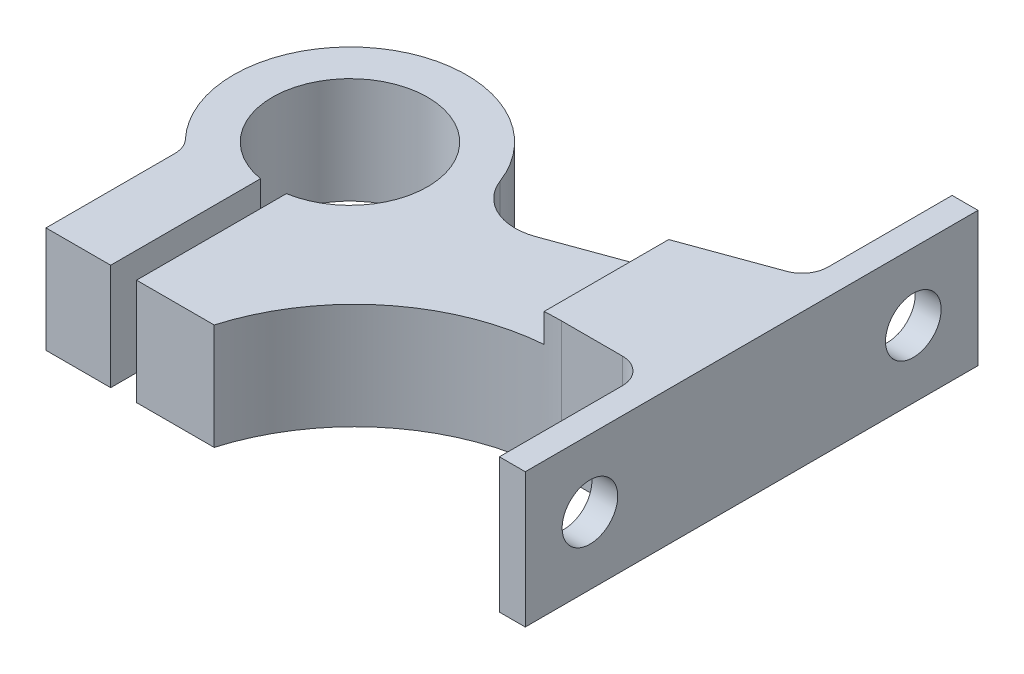
ISO-10303-21;
HEADER;
FILE_DESCRIPTION(('STEP AP214'),'2;1');
FILE_NAME('part.step','',(''),(''),'','','');
FILE_SCHEMA(('AUTOMOTIVE_DESIGN { 1 0 10303 214 1 1 1 1 }'));
ENDSEC;
DATA;
#1=APPLICATION_CONTEXT('core data for automotive mechanical design processes');
#2=APPLICATION_PROTOCOL_DEFINITION('international standard','automotive_design',2000,#1);
#3=PRODUCT_CONTEXT('',#1,'mechanical');
#4=PRODUCT('Part','Part','',(#3));
#5=PRODUCT_RELATED_PRODUCT_CATEGORY('part','',(#4));
#6=PRODUCT_DEFINITION_FORMATION('','',#4);
#7=PRODUCT_DEFINITION_CONTEXT('part definition',#1,'design');
#8=PRODUCT_DEFINITION('design','',#6,#7);
#9=PRODUCT_DEFINITION_SHAPE('','',#8);
#10=(LENGTH_UNIT() NAMED_UNIT(*) SI_UNIT(.MILLI.,.METRE.));
#11=(NAMED_UNIT(*) PLANE_ANGLE_UNIT() SI_UNIT($,.RADIAN.));
#12=(NAMED_UNIT(*) SI_UNIT($,.STERADIAN.) SOLID_ANGLE_UNIT());
#13=UNCERTAINTY_MEASURE_WITH_UNIT(LENGTH_MEASURE(1.E-05),#10,'distance_accuracy_value','');
#14=(GEOMETRIC_REPRESENTATION_CONTEXT(3) GLOBAL_UNCERTAINTY_ASSIGNED_CONTEXT((#13)) GLOBAL_UNIT_ASSIGNED_CONTEXT((#10,
#11,#12)) REPRESENTATION_CONTEXT('',''));
#15=CARTESIAN_POINT('',(0.,0.,0.));
#16=DIRECTION('',(0.,0.,1.));
#17=DIRECTION('',(1.,0.,0.));
#18=AXIS2_PLACEMENT_3D('',#15,#16,#17);
#19=CARTESIAN_POINT('',(-48.,10.4,17.5));
#20=DIRECTION('',(0.,0.,-1.));
#21=DIRECTION('',(-1.,0.,0.));
#22=AXIS2_PLACEMENT_3D('',#19,#20,#21);
#23=PLANE('',#22);
#24=DIRECTION('',(1.,0.,0.));
#25=VECTOR('',#24,1.);
#26=CARTESIAN_POINT('',(-48.,0.,17.5));
#27=LINE('',#26,#25);
#28=CARTESIAN_POINT('',(-37.05,0.,17.5));
#29=VERTEX_POINT('',#28);
#30=CARTESIAN_POINT('',(-32.05,0.,17.5));
#31=VERTEX_POINT('',#30);
#32=EDGE_CURVE('E281',#29,#31,#27,.T.);
#33=ORIENTED_EDGE('',*,*,#32,.T.);
#34=DIRECTION('',(0.,1.,0.));
#35=VECTOR('',#34,1.);
#36=CARTESIAN_POINT('',(-32.05,0.,17.5));
#37=LINE('',#36,#35);
#38=CARTESIAN_POINT('',(-32.05,8.2,17.5));
#39=VERTEX_POINT('',#38);
#40=EDGE_CURVE('E210',#31,#39,#37,.T.);
#41=ORIENTED_EDGE('',*,*,#40,.T.);
#42=DIRECTION('',(1.,0.,0.));
#43=VECTOR('',#42,1.);
#44=CARTESIAN_POINT('',(-48.,8.2,17.5));
#45=LINE('',#44,#43);
#46=CARTESIAN_POINT('',(-37.05,8.2,17.5));
#47=VERTEX_POINT('',#46);
#48=EDGE_CURVE('E262',#47,#39,#45,.T.);
#49=ORIENTED_EDGE('',*,*,#48,.F.);
#50=DIRECTION('',(0.,1.,0.));
#51=VECTOR('',#50,1.);
#52=CARTESIAN_POINT('',(-37.05,0.,17.5));
#53=LINE('',#52,#51);
#54=EDGE_CURVE('E233',#29,#47,#53,.T.);
#55=ORIENTED_EDGE('',*,*,#54,.F.);
#56=EDGE_LOOP('',(#33,#41,#49,#55));
#57=FACE_BOUND('',#56,.T.);
#58=ADVANCED_FACE('F32',(#57),#23,.F.);
#59=DIRECTION('',(1.,0.,0.));
#60=VECTOR('',#59,1.);
#61=CARTESIAN_POINT('',(-48.,10.4,17.5));
#62=LINE('',#61,#60);
#63=CARTESIAN_POINT('',(-1.99999999999999,10.4,17.5));
#64=VERTEX_POINT('',#63);
#65=CARTESIAN_POINT('',(0.,10.4,17.5));
#66=VERTEX_POINT('',#65);
#67=EDGE_CURVE('E272',#64,#66,#62,.T.);
#68=ORIENTED_EDGE('',*,*,#67,.F.);
#69=DIRECTION('',(0.,1.,0.));
#70=VECTOR('',#69,1.);
#71=CARTESIAN_POINT('',(-1.99999999999999,0.,17.5));
#72=LINE('',#71,#70);
#73=CARTESIAN_POINT('',(-1.99999999999999,0.,17.5));
#74=VERTEX_POINT('',#73);
#75=EDGE_CURVE('E251',#74,#64,#72,.T.);
#76=ORIENTED_EDGE('',*,*,#75,.F.);
#77=CARTESIAN_POINT('',(0.,0.,17.5));
#78=VERTEX_POINT('',#77);
#79=EDGE_CURVE('E269',#74,#78,#27,.T.);
#80=ORIENTED_EDGE('',*,*,#79,.T.);
#81=DIRECTION('',(0.,-1.,0.));
#82=VECTOR('',#81,1.);
#83=CARTESIAN_POINT('',(0.,10.4,17.5));
#84=LINE('',#83,#82);
#85=EDGE_CURVE('E291',#66,#78,#84,.T.);
#86=ORIENTED_EDGE('',*,*,#85,.F.);
#87=EDGE_LOOP('',(#68,#76,#80,#86));
#88=FACE_BOUND('',#87,.T.);
#89=ADVANCED_FACE('F396',(#88),#23,.F.);
#90=CARTESIAN_POINT('',(-30.05,8.2,17.5));
#91=VERTEX_POINT('',#90);
#92=CARTESIAN_POINT('',(-24.05,8.2,17.5));
#93=VERTEX_POINT('',#92);
#94=EDGE_CURVE('E266',#91,#93,#45,.T.);
#95=ORIENTED_EDGE('',*,*,#94,.F.);
#96=DIRECTION('',(0.,1.,0.));
#97=VECTOR('',#96,1.);
#98=CARTESIAN_POINT('',(-30.05,0.,17.5));
#99=LINE('',#98,#97);
#100=CARTESIAN_POINT('',(-30.05,0.,17.5));
#101=VERTEX_POINT('',#100);
#102=EDGE_CURVE('E211',#101,#91,#99,.T.);
#103=ORIENTED_EDGE('',*,*,#102,.F.);
#104=CARTESIAN_POINT('',(-24.05,0.,17.5));
#105=VERTEX_POINT('',#104);
#106=EDGE_CURVE('E285',#101,#105,#27,.T.);
#107=ORIENTED_EDGE('',*,*,#106,.T.);
#108=DIRECTION('',(0.,1.,0.));
#109=VECTOR('',#108,1.);
#110=CARTESIAN_POINT('',(-24.05,0.,17.5));
#111=LINE('',#110,#109);
#112=EDGE_CURVE('E247',#105,#93,#111,.T.);
#113=ORIENTED_EDGE('',*,*,#112,.T.);
#114=EDGE_LOOP('',(#95,#103,#107,#113));
#115=FACE_BOUND('',#114,.T.);
#116=ADVANCED_FACE('F404',(#115),#23,.F.);
#117=CARTESIAN_POINT('',(0.,10.4,-17.5));
#118=DIRECTION('',(-1.,0.,0.));
#119=DIRECTION('',(0.,0.,1.));
#120=AXIS2_PLACEMENT_3D('',#117,#118,#119);
#121=PLANE('',#120);
#122=CARTESIAN_POINT('',(0.,5.2,-12.5));
#123=DIRECTION('',(-1.,0.,0.));
#124=DIRECTION('',(0.,0.,1.));
#125=AXIS2_PLACEMENT_3D('',#122,#123,#124);
#126=CIRCLE('',#125,2.15);
#127=CARTESIAN_POINT('',(0.,5.2,-10.35));
#128=VERTEX_POINT('',#127);
#129=EDGE_CURVE('E702',#128,#128,#126,.T.);
#130=ORIENTED_EDGE('',*,*,#129,.T.);
#131=EDGE_LOOP('',(#130));
#132=FACE_BOUND('',#131,.T.);
#133=CARTESIAN_POINT('',(0.,5.2,12.5));
#134=DIRECTION('',(-1.,0.,0.));
#135=DIRECTION('',(0.,0.,1.));
#136=AXIS2_PLACEMENT_3D('',#133,#134,#135);
#137=CIRCLE('',#136,2.15);
#138=CARTESIAN_POINT('',(0.,5.2,14.65));
#139=VERTEX_POINT('',#138);
#140=EDGE_CURVE('E192',#139,#139,#137,.T.);
#141=ORIENTED_EDGE('',*,*,#140,.T.);
#142=EDGE_LOOP('',(#141));
#143=FACE_BOUND('',#142,.T.);
#144=DIRECTION('',(0.,0.,-1.));
#145=VECTOR('',#144,1.);
#146=CARTESIAN_POINT('',(0.,0.,-17.5));
#147=LINE('',#146,#145);
#148=CARTESIAN_POINT('',(0.,0.,-17.5));
#149=VERTEX_POINT('',#148);
#150=EDGE_CURVE('E284',#78,#149,#147,.T.);
#151=ORIENTED_EDGE('',*,*,#150,.T.);
#152=DIRECTION('',(0.,-1.,0.));
#153=VECTOR('',#152,1.);
#154=CARTESIAN_POINT('',(0.,10.4,-17.5));
#155=LINE('',#154,#153);
#156=CARTESIAN_POINT('',(0.,10.4,-17.5));
#157=VERTEX_POINT('',#156);
#158=EDGE_CURVE('E280',#157,#149,#155,.T.);
#159=ORIENTED_EDGE('',*,*,#158,.F.);
#160=DIRECTION('',(0.,0.,-1.));
#161=VECTOR('',#160,1.);
#162=CARTESIAN_POINT('',(0.,10.4,-17.5));
#163=LINE('',#162,#161);
#164=EDGE_CURVE('E274',#66,#157,#163,.T.);
#165=ORIENTED_EDGE('',*,*,#164,.F.);
#166=ORIENTED_EDGE('',*,*,#85,.T.);
#167=EDGE_LOOP('',(#151,#159,#165,#166));
#168=FACE_BOUND('',#167,.T.);
#169=ADVANCED_FACE('F391',(#132,#143,#168),#121,.F.);
#170=CARTESIAN_POINT('',(-48.,10.4,-17.5));
#171=DIRECTION('',(0.,0.,1.));
#172=DIRECTION('',(1.,0.,0.));
#173=AXIS2_PLACEMENT_3D('',#170,#171,#172);
#174=PLANE('',#173);
#175=DIRECTION('',(-1.,0.,0.));
#176=VECTOR('',#175,1.);
#177=CARTESIAN_POINT('',(-48.,0.,-17.5));
#178=LINE('',#177,#176);
#179=CARTESIAN_POINT('',(-2.,0.,-17.5));
#180=VERTEX_POINT('',#179);
#181=EDGE_CURVE('E275',#149,#180,#178,.T.);
#182=ORIENTED_EDGE('',*,*,#181,.T.);
#183=DIRECTION('',(0.,1.,0.));
#184=VECTOR('',#183,1.);
#185=CARTESIAN_POINT('',(-2.,0.,-17.5));
#186=LINE('',#185,#184);
#187=CARTESIAN_POINT('',(-2.,10.4,-17.5));
#188=VERTEX_POINT('',#187);
#189=EDGE_CURVE('E229',#180,#188,#186,.T.);
#190=ORIENTED_EDGE('',*,*,#189,.T.);
#191=DIRECTION('',(-1.,0.,0.));
#192=VECTOR('',#191,1.);
#193=CARTESIAN_POINT('',(-48.,10.4,-17.5));
#194=LINE('',#193,#192);
#195=EDGE_CURVE('E277',#157,#188,#194,.T.);
#196=ORIENTED_EDGE('',*,*,#195,.F.);
#197=ORIENTED_EDGE('',*,*,#158,.T.);
#198=EDGE_LOOP('',(#182,#190,#196,#197));
#199=FACE_BOUND('',#198,.T.);
#200=ADVANCED_FACE('F386',(#199),#174,.F.);
#201=CARTESIAN_POINT('',(-48.,10.4,17.5));
#202=DIRECTION('',(0.,1.,0.));
#203=DIRECTION('',(0.,0.,1.));
#204=AXIS2_PLACEMENT_3D('',#201,#202,#203);
#205=PLANE('',#204);
#206=DIRECTION('',(0.,0.,-1.));
#207=VECTOR('',#206,1.);
#208=CARTESIAN_POINT('',(-2.,10.4,-6.5));
#209=LINE('',#208,#207);
#210=CARTESIAN_POINT('',(-2.,10.4,-7.90041507641942));
#211=VERTEX_POINT('',#210);
#212=EDGE_CURVE('E219',#211,#188,#209,.T.);
#213=ORIENTED_EDGE('',*,*,#212,.F.);
#214=CARTESIAN_POINT('',(-3.99999999999999,10.4,-7.90041507641942));
#215=DIRECTION('',(0.,1.,0.));
#216=DIRECTION('',(0.,0.,1.));
#217=AXIS2_PLACEMENT_3D('',#214,#215,#216);
#218=CIRCLE('',#217,2.);
#219=CARTESIAN_POINT('',(-3.31595971334866,10.4,-6.0210298348476));
#220=VERTEX_POINT('',#219);
#221=EDGE_CURVE('E331',#211,#220,#218,.F.);
#222=ORIENTED_EDGE('',*,*,#221,.T.);
#223=DIRECTION('',(0.939692620785908,0.,-0.34202014332567));
#224=VECTOR('',#223,1.);
#225=CARTESIAN_POINT('',(-2.,10.4,-6.5));
#226=LINE('',#225,#224);
#227=CARTESIAN_POINT('',(-9.99999999999999,10.4,-3.58823812587038));
#228=VERTEX_POINT('',#227);
#229=EDGE_CURVE('E223',#228,#220,#226,.T.);
#230=ORIENTED_EDGE('',*,*,#229,.F.);
#231=DIRECTION('',(0.,0.,-1.));
#232=VECTOR('',#231,1.);
#233=CARTESIAN_POINT('',(-9.99999999999999,10.4,-17.5));
#234=LINE('',#233,#232);
#235=CARTESIAN_POINT('',(-9.99999999999999,10.4,6.05323900689445));
#236=VERTEX_POINT('',#235);
#237=EDGE_CURVE('E259',#236,#228,#234,.T.);
#238=ORIENTED_EDGE('',*,*,#237,.F.);
#239=CARTESIAN_POINT('',(-8.69584746721591,10.4,22.));
#240=DIRECTION('',(0.,1.,0.));
#241=DIRECTION('',(0.,0.,1.));
#242=AXIS2_PLACEMENT_3D('',#239,#240,#241);
#243=CIRCLE('',#242,16.);
#244=CARTESIAN_POINT('',(-8.69584746721591,10.4,6.));
#245=VERTEX_POINT('',#244);
#246=EDGE_CURVE('E315',#236,#245,#243,.F.);
#247=ORIENTED_EDGE('',*,*,#246,.T.);
#248=DIRECTION('',(-1.,0.,0.));
#249=VECTOR('',#248,1.);
#250=CARTESIAN_POINT('',(-1.99999999999999,10.4,6.));
#251=LINE('',#250,#249);
#252=CARTESIAN_POINT('',(-3.99999999999999,10.4,6.));
#253=VERTEX_POINT('',#252);
#254=EDGE_CURVE('E245',#253,#245,#251,.T.);
#255=ORIENTED_EDGE('',*,*,#254,.F.);
#256=CARTESIAN_POINT('',(-3.99999999999999,10.4,8.));
#257=DIRECTION('',(0.,1.,0.));
#258=DIRECTION('',(0.,0.,1.));
#259=AXIS2_PLACEMENT_3D('',#256,#257,#258);
#260=CIRCLE('',#259,2.);
#261=CARTESIAN_POINT('',(-1.99999999999999,10.4,8.));
#262=VERTEX_POINT('',#261);
#263=EDGE_CURVE('E335',#253,#262,#260,.F.);
#264=ORIENTED_EDGE('',*,*,#263,.T.);
#265=DIRECTION('',(0.,0.,-1.));
#266=VECTOR('',#265,1.);
#267=CARTESIAN_POINT('',(-1.99999999999999,10.4,17.5));
#268=LINE('',#267,#266);
#269=EDGE_CURVE('E240',#64,#262,#268,.T.);
#270=ORIENTED_EDGE('',*,*,#269,.F.);
#271=ORIENTED_EDGE('',*,*,#67,.T.);
#272=ORIENTED_EDGE('',*,*,#164,.T.);
#273=ORIENTED_EDGE('',*,*,#195,.T.);
#274=EDGE_LOOP('',(#213,#222,#230,#238,#247,#255,#264,#270,#271,#272,#273));
#275=FACE_BOUND('',#274,.T.);
#276=ADVANCED_FACE('F455',(#275),#205,.T.);
#277=CARTESIAN_POINT('',(-48.,0.,17.5));
#278=DIRECTION('',(0.,1.,0.));
#279=DIRECTION('',(0.,0.,1.));
#280=AXIS2_PLACEMENT_3D('',#277,#278,#279);
#281=PLANE('',#280);
#282=CARTESIAN_POINT('',(-31.05,0.,0.));
#283=DIRECTION('',(0.,1.,0.));
#284=DIRECTION('',(0.,0.,1.));
#285=AXIS2_PLACEMENT_3D('',#282,#283,#284);
#286=CIRCLE('',#285,6.);
#287=CARTESIAN_POINT('',(-30.05,0.,5.91607978309962));
#288=VERTEX_POINT('',#287);
#289=CARTESIAN_POINT('',(-32.05,0.,5.91607978309962));
#290=VERTEX_POINT('',#289);
#291=EDGE_CURVE('E256',#288,#290,#286,.T.);
#292=ORIENTED_EDGE('',*,*,#291,.T.);
#293=DIRECTION('',(0.,0.,1.));
#294=VECTOR('',#293,1.);
#295=CARTESIAN_POINT('',(-32.05,0.,0.));
#296=LINE('',#295,#294);
#297=EDGE_CURVE('E202',#290,#31,#296,.T.);
#298=ORIENTED_EDGE('',*,*,#297,.T.);
#299=ORIENTED_EDGE('',*,*,#32,.F.);
#300=DIRECTION('',(0.,0.,-1.));
#301=VECTOR('',#300,1.);
#302=CARTESIAN_POINT('',(-37.05,0.,17.5));
#303=LINE('',#302,#301);
#304=CARTESIAN_POINT('',(-37.05,0.,7.54983443527075));
#305=VERTEX_POINT('',#304);
#306=EDGE_CURVE('E222',#29,#305,#303,.T.);
#307=ORIENTED_EDGE('',*,*,#306,.T.);
#308=CARTESIAN_POINT('',(-39.05,0.,7.54983443527075));
#309=DIRECTION('',(0.,1.,0.));
#310=DIRECTION('',(0.,0.,1.));
#311=AXIS2_PLACEMENT_3D('',#308,#309,#310);
#312=CIRCLE('',#311,2.);
#313=CARTESIAN_POINT('',(-37.5954545454545,0.,6.17713726522152));
#314=VERTEX_POINT('',#313);
#315=EDGE_CURVE('E11',#305,#314,#312,.T.);
#316=ORIENTED_EDGE('',*,*,#315,.T.);
#317=CARTESIAN_POINT('',(-31.05,0.,0.));
#318=DIRECTION('',(0.,-1.,0.));
#319=DIRECTION('',(0.,0.,1.));
#320=AXIS2_PLACEMENT_3D('',#317,#318,#319);
#321=CIRCLE('',#320,9.);
#322=CARTESIAN_POINT('',(-22.6343111447728,0.,-3.19001271032035));
#323=VERTEX_POINT('',#322);
#324=EDGE_CURVE('E225',#314,#323,#321,.T.);
#325=ORIENTED_EDGE('',*,*,#324,.T.);
#326=CARTESIAN_POINT('',(-18.8940049868941,0.,-4.6077961371294));
#327=DIRECTION('',(0.,1.,0.));
#328=DIRECTION('',(0.,0.,1.));
#329=AXIS2_PLACEMENT_3D('',#326,#327,#328);
#330=CIRCLE('',#329,4.);
#331=CARTESIAN_POINT('',(-17.5259244135914,0.,-0.849025653985764));
#332=VERTEX_POINT('',#331);
#333=EDGE_CURVE('E348',#323,#332,#330,.T.);
#334=ORIENTED_EDGE('',*,*,#333,.T.);
#335=DIRECTION('',(0.939692620785908,0.,-0.34202014332567));
#336=VECTOR('',#335,1.);
#337=CARTESIAN_POINT('',(-2.,0.,-6.5));
#338=LINE('',#337,#336);
#339=CARTESIAN_POINT('',(-3.31595971334866,0.,-6.0210298348476));
#340=VERTEX_POINT('',#339);
#341=EDGE_CURVE('E227',#332,#340,#338,.T.);
#342=ORIENTED_EDGE('',*,*,#341,.T.);
#343=CARTESIAN_POINT('',(-3.99999999999999,0.,-7.90041507641942));
#344=DIRECTION('',(0.,1.,0.));
#345=DIRECTION('',(0.,0.,1.));
#346=AXIS2_PLACEMENT_3D('',#343,#344,#345);
#347=CIRCLE('',#346,2.);
#348=CARTESIAN_POINT('',(-2.,0.,-7.90041507641942));
#349=VERTEX_POINT('',#348);
#350=EDGE_CURVE('E333',#340,#349,#347,.T.);
#351=ORIENTED_EDGE('',*,*,#350,.T.);
#352=DIRECTION('',(0.,0.,-1.));
#353=VECTOR('',#352,1.);
#354=CARTESIAN_POINT('',(-2.,0.,-6.5));
#355=LINE('',#354,#353);
#356=EDGE_CURVE('E220',#349,#180,#355,.T.);
#357=ORIENTED_EDGE('',*,*,#356,.T.);
#358=ORIENTED_EDGE('',*,*,#181,.F.);
#359=ORIENTED_EDGE('',*,*,#150,.F.);
#360=ORIENTED_EDGE('',*,*,#79,.F.);
#361=DIRECTION('',(0.,0.,-1.));
#362=VECTOR('',#361,1.);
#363=CARTESIAN_POINT('',(-1.99999999999999,0.,17.5));
#364=LINE('',#363,#362);
#365=CARTESIAN_POINT('',(-1.99999999999999,0.,8.));
#366=VERTEX_POINT('',#365);
#367=EDGE_CURVE('E241',#74,#366,#364,.T.);
#368=ORIENTED_EDGE('',*,*,#367,.T.);
#369=CARTESIAN_POINT('',(-3.99999999999999,0.,8.));
#370=DIRECTION('',(0.,1.,0.));
#371=DIRECTION('',(0.,0.,1.));
#372=AXIS2_PLACEMENT_3D('',#369,#370,#371);
#373=CIRCLE('',#372,2.);
#374=CARTESIAN_POINT('',(-3.99999999999999,0.,6.));
#375=VERTEX_POINT('',#374);
#376=EDGE_CURVE('E337',#366,#375,#373,.T.);
#377=ORIENTED_EDGE('',*,*,#376,.T.);
#378=DIRECTION('',(-1.,0.,0.));
#379=VECTOR('',#378,1.);
#380=CARTESIAN_POINT('',(-1.99999999999999,0.,6.));
#381=LINE('',#380,#379);
#382=CARTESIAN_POINT('',(-8.69584746721591,0.,6.));
#383=VERTEX_POINT('',#382);
#384=EDGE_CURVE('E244',#375,#383,#381,.T.);
#385=ORIENTED_EDGE('',*,*,#384,.T.);
#386=CARTESIAN_POINT('',(-8.69584746721591,0.,22.));
#387=DIRECTION('',(0.,1.,0.));
#388=DIRECTION('',(0.,0.,1.));
#389=AXIS2_PLACEMENT_3D('',#386,#387,#388);
#390=CIRCLE('',#389,16.);
#391=EDGE_CURVE('E318',#383,#105,#390,.T.);
#392=ORIENTED_EDGE('',*,*,#391,.T.);
#393=ORIENTED_EDGE('',*,*,#106,.F.);
#394=DIRECTION('',(0.,0.,-1.));
#395=VECTOR('',#394,1.);
#396=CARTESIAN_POINT('',(-30.05,0.,0.));
#397=LINE('',#396,#395);
#398=EDGE_CURVE('E207',#101,#288,#397,.T.);
#399=ORIENTED_EDGE('',*,*,#398,.T.);
#400=EDGE_LOOP('',(#292,#298,#299,#307,#316,#325,#334,#342,#351,#357,#358,#359,#360,#368,#377,
#385,#392,#393,#399));
#401=FACE_BOUND('',#400,.T.);
#402=ADVANCED_FACE('F369',(#401),#281,.F.);
#403=CARTESIAN_POINT('',(-9.99999999999999,8.2,-17.5));
#404=DIRECTION('',(1.,0.,0.));
#405=DIRECTION('',(0.,0.,-1.));
#406=AXIS2_PLACEMENT_3D('',#403,#404,#405);
#407=PLANE('',#406);
#408=ORIENTED_EDGE('',*,*,#237,.T.);
#409=DIRECTION('',(0.,-1.,0.));
#410=VECTOR('',#409,1.);
#411=CARTESIAN_POINT('',(-9.99999999999999,8.2,-3.58823812587038));
#412=LINE('',#411,#410);
#413=CARTESIAN_POINT('',(-9.99999999999999,8.2,-3.58823812587038));
#414=VERTEX_POINT('',#413);
#415=EDGE_CURVE('E235',#228,#414,#412,.T.);
#416=ORIENTED_EDGE('',*,*,#415,.T.);
#417=DIRECTION('',(0.,0.,-1.));
#418=VECTOR('',#417,1.);
#419=CARTESIAN_POINT('',(-9.99999999999999,8.2,-17.5));
#420=LINE('',#419,#418);
#421=CARTESIAN_POINT('',(-9.99999999999999,8.2,6.05323900689445));
#422=VERTEX_POINT('',#421);
#423=EDGE_CURVE('E265',#422,#414,#420,.T.);
#424=ORIENTED_EDGE('',*,*,#423,.F.);
#425=DIRECTION('',(0.,-1.,0.));
#426=VECTOR('',#425,1.);
#427=CARTESIAN_POINT('',(-9.99999999999999,8.2,6.05323900689445));
#428=LINE('',#427,#426);
#429=EDGE_CURVE('E312',#422,#236,#428,.F.);
#430=ORIENTED_EDGE('',*,*,#429,.T.);
#431=EDGE_LOOP('',(#408,#416,#424,#430));
#432=FACE_BOUND('',#431,.T.);
#433=ADVANCED_FACE('F462',(#432),#407,.F.);
#434=CARTESIAN_POINT('',(-48.,8.2,17.5));
#435=DIRECTION('',(0.,1.,0.));
#436=DIRECTION('',(0.,0.,1.));
#437=AXIS2_PLACEMENT_3D('',#434,#435,#436);
#438=PLANE('',#437);
#439=DIRECTION('',(0.,0.,1.));
#440=VECTOR('',#439,1.);
#441=CARTESIAN_POINT('',(-32.05,8.2,17.5));
#442=LINE('',#441,#440);
#443=CARTESIAN_POINT('',(-32.05,8.2,5.91607978309962));
#444=VERTEX_POINT('',#443);
#445=EDGE_CURVE('E217',#444,#39,#442,.T.);
#446=ORIENTED_EDGE('',*,*,#445,.F.);
#447=CARTESIAN_POINT('',(-31.05,8.2,0.));
#448=DIRECTION('',(0.,1.,0.));
#449=DIRECTION('',(0.,0.,1.));
#450=AXIS2_PLACEMENT_3D('',#447,#448,#449);
#451=CIRCLE('',#450,6.);
#452=CARTESIAN_POINT('',(-30.05,8.2,5.91607978309962));
#453=VERTEX_POINT('',#452);
#454=EDGE_CURVE('E253',#453,#444,#451,.T.);
#455=ORIENTED_EDGE('',*,*,#454,.F.);
#456=DIRECTION('',(0.,0.,-1.));
#457=VECTOR('',#456,1.);
#458=CARTESIAN_POINT('',(-30.05,8.2,17.5));
#459=LINE('',#458,#457);
#460=EDGE_CURVE('E213',#91,#453,#459,.T.);
#461=ORIENTED_EDGE('',*,*,#460,.F.);
#462=ORIENTED_EDGE('',*,*,#94,.T.);
#463=CARTESIAN_POINT('',(-8.69584746721591,8.2,22.));
#464=DIRECTION('',(0.,1.,0.));
#465=DIRECTION('',(0.,0.,1.));
#466=AXIS2_PLACEMENT_3D('',#463,#464,#465);
#467=CIRCLE('',#466,16.);
#468=EDGE_CURVE('E309',#93,#422,#467,.F.);
#469=ORIENTED_EDGE('',*,*,#468,.T.);
#470=ORIENTED_EDGE('',*,*,#423,.T.);
#471=DIRECTION('',(0.939692620785908,0.,-0.34202014332567));
#472=VECTOR('',#471,1.);
#473=CARTESIAN_POINT('',(-50.3324735079749,8.2,11.0915817053627));
#474=LINE('',#473,#472);
#475=CARTESIAN_POINT('',(-17.5259244135914,8.2,-0.849025653985765));
#476=VERTEX_POINT('',#475);
#477=EDGE_CURVE('E298',#476,#414,#474,.T.);
#478=ORIENTED_EDGE('',*,*,#477,.F.);
#479=CARTESIAN_POINT('',(-18.8940049868941,8.2,-4.6077961371294));
#480=DIRECTION('',(0.,1.,0.));
#481=DIRECTION('',(0.,0.,1.));
#482=AXIS2_PLACEMENT_3D('',#479,#480,#481);
#483=CIRCLE('',#482,4.);
#484=CARTESIAN_POINT('',(-22.6343111447728,8.2,-3.19001271032035));
#485=VERTEX_POINT('',#484);
#486=EDGE_CURVE('E345',#476,#485,#483,.F.);
#487=ORIENTED_EDGE('',*,*,#486,.T.);
#488=CARTESIAN_POINT('',(-31.05,8.2,0.));
#489=DIRECTION('',(0.,1.,0.));
#490=DIRECTION('',(0.,0.,1.));
#491=AXIS2_PLACEMENT_3D('',#488,#489,#490);
#492=CIRCLE('',#491,9.);
#493=CARTESIAN_POINT('',(-37.5954545454545,8.2,6.17713726522152));
#494=VERTEX_POINT('',#493);
#495=EDGE_CURVE('E296',#494,#485,#492,.F.);
#496=ORIENTED_EDGE('',*,*,#495,.F.);
#497=CARTESIAN_POINT('',(-39.05,8.2,7.54983443527075));
#498=DIRECTION('',(0.,1.,0.));
#499=DIRECTION('',(0.,0.,1.));
#500=AXIS2_PLACEMENT_3D('',#497,#498,#499);
#501=CIRCLE('',#500,2.);
#502=CARTESIAN_POINT('',(-37.05,8.2,7.54983443527075));
#503=VERTEX_POINT('',#502);
#504=EDGE_CURVE('E40',#494,#503,#501,.F.);
#505=ORIENTED_EDGE('',*,*,#504,.T.);
#506=DIRECTION('',(0.,0.,-1.));
#507=VECTOR('',#506,1.);
#508=CARTESIAN_POINT('',(-37.05,8.2,17.5));
#509=LINE('',#508,#507);
#510=EDGE_CURVE('E294',#47,#503,#509,.T.);
#511=ORIENTED_EDGE('',*,*,#510,.F.);
#512=ORIENTED_EDGE('',*,*,#48,.T.);
#513=EDGE_LOOP('',(#446,#455,#461,#462,#469,#470,#478,#487,#496,#505,#511,#512));
#514=FACE_BOUND('',#513,.T.);
#515=ADVANCED_FACE('F360',(#514),#438,.T.);
#516=CARTESIAN_POINT('',(-31.05,0.,0.));
#517=DIRECTION('',(0.,1.,0.));
#518=DIRECTION('',(0.,0.,1.));
#519=AXIS2_PLACEMENT_3D('',#516,#517,#518);
#520=CYLINDRICAL_SURFACE('',#519,6.);
#521=ORIENTED_EDGE('',*,*,#454,.T.);
#522=DIRECTION('',(0.,1.,0.));
#523=VECTOR('',#522,1.);
#524=CARTESIAN_POINT('',(-32.05,0.,5.91607978309962));
#525=LINE('',#524,#523);
#526=EDGE_CURVE('E303',#444,#290,#525,.F.);
#527=ORIENTED_EDGE('',*,*,#526,.T.);
#528=ORIENTED_EDGE('',*,*,#291,.F.);
#529=DIRECTION('',(0.,1.,0.));
#530=VECTOR('',#529,1.);
#531=CARTESIAN_POINT('',(-30.05,0.,5.91607978309962));
#532=LINE('',#531,#530);
#533=EDGE_CURVE('E300',#288,#453,#532,.T.);
#534=ORIENTED_EDGE('',*,*,#533,.T.);
#535=EDGE_LOOP('',(#521,#527,#528,#534));
#536=FACE_BOUND('',#535,.T.);
#537=ADVANCED_FACE('F417',(#536),#520,.F.);
#538=CARTESIAN_POINT('',(-1.99999999999999,0.,6.));
#539=DIRECTION('',(0.,0.,-1.));
#540=DIRECTION('',(-1.,0.,0.));
#541=AXIS2_PLACEMENT_3D('',#538,#539,#540);
#542=PLANE('',#541);
#543=ORIENTED_EDGE('',*,*,#384,.F.);
#544=DIRECTION('',(0.,1.,0.));
#545=VECTOR('',#544,1.);
#546=CARTESIAN_POINT('',(-3.99999999999999,10.4,6.));
#547=LINE('',#546,#545);
#548=EDGE_CURVE('E326',#375,#253,#547,.T.);
#549=ORIENTED_EDGE('',*,*,#548,.T.);
#550=ORIENTED_EDGE('',*,*,#254,.T.);
#551=DIRECTION('',(0.,-1.,0.));
#552=VECTOR('',#551,1.);
#553=CARTESIAN_POINT('',(-8.69584746721591,0.,6.));
#554=LINE('',#553,#552);
#555=EDGE_CURVE('E306',#245,#383,#554,.T.);
#556=ORIENTED_EDGE('',*,*,#555,.T.);
#557=EDGE_LOOP('',(#543,#549,#550,#556));
#558=FACE_BOUND('',#557,.T.);
#559=ADVANCED_FACE('F473',(#558),#542,.F.);
#560=CARTESIAN_POINT('',(-1.99999999999999,0.,17.5));
#561=DIRECTION('',(1.,0.,0.));
#562=DIRECTION('',(0.,0.,-1.));
#563=AXIS2_PLACEMENT_3D('',#560,#561,#562);
#564=PLANE('',#563);
#565=CARTESIAN_POINT('',(-1.99999999999999,5.2,12.5));
#566=DIRECTION('',(-1.,0.,0.));
#567=DIRECTION('',(0.,0.,1.));
#568=AXIS2_PLACEMENT_3D('',#565,#566,#567);
#569=CIRCLE('',#568,2.15);
#570=CARTESIAN_POINT('',(-1.99999999999999,5.2,14.65));
#571=VERTEX_POINT('',#570);
#572=EDGE_CURVE('E707',#571,#571,#569,.T.);
#573=ORIENTED_EDGE('',*,*,#572,.F.);
#574=EDGE_LOOP('',(#573));
#575=FACE_BOUND('',#574,.T.);
#576=ORIENTED_EDGE('',*,*,#269,.T.);
#577=DIRECTION('',(0.,1.,0.));
#578=VECTOR('',#577,1.);
#579=CARTESIAN_POINT('',(-1.99999999999999,0.,8.));
#580=LINE('',#579,#578);
#581=EDGE_CURVE('E329',#262,#366,#580,.F.);
#582=ORIENTED_EDGE('',*,*,#581,.T.);
#583=ORIENTED_EDGE('',*,*,#367,.F.);
#584=ORIENTED_EDGE('',*,*,#75,.T.);
#585=EDGE_LOOP('',(#576,#582,#583,#584));
#586=FACE_BOUND('',#585,.T.);
#587=ADVANCED_FACE('F474',(#575,#586),#564,.F.);
#588=CARTESIAN_POINT('',(-2.,0.,-6.5));
#589=DIRECTION('',(0.34202014332567,0.,0.939692620785908));
#590=DIRECTION('',(0.939692620785908,0.,-0.34202014332567));
#591=AXIS2_PLACEMENT_3D('',#588,#589,#590);
#592=PLANE('',#591);
#593=ORIENTED_EDGE('',*,*,#341,.F.);
#594=DIRECTION('',(0.,-1.,0.));
#595=VECTOR('',#594,1.);
#596=CARTESIAN_POINT('',(-17.5259244135914,8.2,-0.849025653985764));
#597=LINE('',#596,#595);
#598=EDGE_CURVE('E339',#332,#476,#597,.F.);
#599=ORIENTED_EDGE('',*,*,#598,.T.);
#600=ORIENTED_EDGE('',*,*,#477,.T.);
#601=ORIENTED_EDGE('',*,*,#415,.F.);
#602=ORIENTED_EDGE('',*,*,#229,.T.);
#603=DIRECTION('',(0.,1.,0.));
#604=VECTOR('',#603,1.);
#605=CARTESIAN_POINT('',(-3.31595971334866,0.,-6.0210298348476));
#606=LINE('',#605,#604);
#607=EDGE_CURVE('E323',#220,#340,#606,.F.);
#608=ORIENTED_EDGE('',*,*,#607,.T.);
#609=EDGE_LOOP('',(#593,#599,#600,#601,#602,#608));
#610=FACE_BOUND('',#609,.T.);
#611=ADVANCED_FACE('F371',(#610),#592,.F.);
#612=CARTESIAN_POINT('',(-2.,0.,-6.5));
#613=DIRECTION('',(1.,0.,0.));
#614=DIRECTION('',(0.,0.,-1.));
#615=AXIS2_PLACEMENT_3D('',#612,#613,#614);
#616=PLANE('',#615);
#617=CARTESIAN_POINT('',(-1.99999999999999,5.2,-12.5));
#618=DIRECTION('',(-1.,0.,0.));
#619=DIRECTION('',(0.,0.,1.));
#620=AXIS2_PLACEMENT_3D('',#617,#618,#619);
#621=CIRCLE('',#620,2.15);
#622=CARTESIAN_POINT('',(-1.99999999999999,5.2,-10.35));
#623=VERTEX_POINT('',#622);
#624=EDGE_CURVE('E705',#623,#623,#621,.T.);
#625=ORIENTED_EDGE('',*,*,#624,.F.);
#626=EDGE_LOOP('',(#625));
#627=FACE_BOUND('',#626,.T.);
#628=ORIENTED_EDGE('',*,*,#356,.F.);
#629=DIRECTION('',(0.,1.,0.));
#630=VECTOR('',#629,1.);
#631=CARTESIAN_POINT('',(-2.,10.4,-7.90041507641942));
#632=LINE('',#631,#630);
#633=EDGE_CURVE('E320',#349,#211,#632,.T.);
#634=ORIENTED_EDGE('',*,*,#633,.T.);
#635=ORIENTED_EDGE('',*,*,#212,.T.);
#636=ORIENTED_EDGE('',*,*,#189,.F.);
#637=EDGE_LOOP('',(#628,#634,#635,#636));
#638=FACE_BOUND('',#637,.T.);
#639=ADVANCED_FACE('F382',(#627,#638),#616,.F.);
#640=CARTESIAN_POINT('',(-31.05,0.,0.));
#641=DIRECTION('',(0.,1.,0.));
#642=DIRECTION('',(0.,0.,1.));
#643=AXIS2_PLACEMENT_3D('',#640,#641,#642);
#644=CYLINDRICAL_SURFACE('',#643,9.);
#645=ORIENTED_EDGE('',*,*,#324,.F.);
#646=DIRECTION('',(0.,1.,0.));
#647=VECTOR('',#646,1.);
#648=CARTESIAN_POINT('',(-37.5954545454545,0.,6.17713726522152));
#649=LINE('',#648,#647);
#650=EDGE_CURVE('E350',#314,#494,#649,.T.);
#651=ORIENTED_EDGE('',*,*,#650,.T.);
#652=ORIENTED_EDGE('',*,*,#495,.T.);
#653=DIRECTION('',(0.,1.,0.));
#654=VECTOR('',#653,1.);
#655=CARTESIAN_POINT('',(-22.6343111447728,0.,-3.19001271032035));
#656=LINE('',#655,#654);
#657=EDGE_CURVE('E342',#485,#323,#656,.F.);
#658=ORIENTED_EDGE('',*,*,#657,.T.);
#659=EDGE_LOOP('',(#645,#651,#652,#658));
#660=FACE_BOUND('',#659,.T.);
#661=ADVANCED_FACE('F356',(#660),#644,.T.);
#662=CARTESIAN_POINT('',(-37.05,0.,17.5));
#663=DIRECTION('',(1.,0.,0.));
#664=DIRECTION('',(0.,0.,-1.));
#665=AXIS2_PLACEMENT_3D('',#662,#663,#664);
#666=PLANE('',#665);
#667=CARTESIAN_POINT('',(-37.05,4.1,12.));
#668=DIRECTION('',(-1.,0.,0.));
#669=DIRECTION('',(0.,0.,1.));
#670=AXIS2_PLACEMENT_3D('',#667,#668,#669);
#671=CIRCLE('',#670,3.);
#672=CARTESIAN_POINT('',(-37.05,4.1,15.));
#673=VERTEX_POINT('',#672);
#674=EDGE_CURVE('E198',#673,#673,#671,.T.);
#675=ORIENTED_EDGE('',*,*,#674,.F.);
#676=EDGE_LOOP('',(#675));
#677=FACE_BOUND('',#676,.T.);
#678=ORIENTED_EDGE('',*,*,#510,.T.);
#679=DIRECTION('',(0.,-1.,0.));
#680=VECTOR('',#679,1.);
#681=CARTESIAN_POINT('',(-37.05,0.,7.54983443527075));
#682=LINE('',#681,#680);
#683=EDGE_CURVE('E47',#503,#305,#682,.T.);
#684=ORIENTED_EDGE('',*,*,#683,.T.);
#685=ORIENTED_EDGE('',*,*,#306,.F.);
#686=ORIENTED_EDGE('',*,*,#54,.T.);
#687=EDGE_LOOP('',(#678,#684,#685,#686));
#688=FACE_BOUND('',#687,.T.);
#689=ADVANCED_FACE('F423',(#677,#688),#666,.F.);
#690=CARTESIAN_POINT('',(-30.05,0.,0.));
#691=DIRECTION('',(1.,0.,0.));
#692=DIRECTION('',(0.,0.,-1.));
#693=AXIS2_PLACEMENT_3D('',#690,#691,#692);
#694=PLANE('',#693);
#695=CARTESIAN_POINT('',(-30.05,4.1,12.));
#696=DIRECTION('',(-1.,0.,0.));
#697=DIRECTION('',(0.,0.,1.));
#698=AXIS2_PLACEMENT_3D('',#695,#696,#697);
#699=CIRCLE('',#698,1.25);
#700=CARTESIAN_POINT('',(-30.05,4.1,13.25));
#701=VERTEX_POINT('',#700);
#702=EDGE_CURVE('E186',#701,#701,#699,.T.);
#703=ORIENTED_EDGE('',*,*,#702,.F.);
#704=EDGE_LOOP('',(#703));
#705=FACE_BOUND('',#704,.T.);
#706=ORIENTED_EDGE('',*,*,#460,.T.);
#707=ORIENTED_EDGE('',*,*,#533,.F.);
#708=ORIENTED_EDGE('',*,*,#398,.F.);
#709=ORIENTED_EDGE('',*,*,#102,.T.);
#710=EDGE_LOOP('',(#706,#707,#708,#709));
#711=FACE_BOUND('',#710,.T.);
#712=ADVANCED_FACE('F414',(#705,#711),#694,.F.);
#713=CARTESIAN_POINT('',(-32.05,0.,0.));
#714=DIRECTION('',(-1.,0.,0.));
#715=DIRECTION('',(0.,0.,1.));
#716=AXIS2_PLACEMENT_3D('',#713,#714,#715);
#717=PLANE('',#716);
#718=CARTESIAN_POINT('',(-32.05,4.1,12.));
#719=DIRECTION('',(-1.,0.,0.));
#720=DIRECTION('',(0.,0.,1.));
#721=AXIS2_PLACEMENT_3D('',#718,#719,#720);
#722=CIRCLE('',#721,1.8);
#723=CARTESIAN_POINT('',(-32.05,4.1,13.8));
#724=VERTEX_POINT('',#723);
#725=EDGE_CURVE('E185',#724,#724,#722,.F.);
#726=ORIENTED_EDGE('',*,*,#725,.F.);
#727=EDGE_LOOP('',(#726));
#728=FACE_BOUND('',#727,.T.);
#729=ORIENTED_EDGE('',*,*,#445,.T.);
#730=ORIENTED_EDGE('',*,*,#40,.F.);
#731=ORIENTED_EDGE('',*,*,#297,.F.);
#732=ORIENTED_EDGE('',*,*,#526,.F.);
#733=EDGE_LOOP('',(#729,#730,#731,#732));
#734=FACE_BOUND('',#733,.T.);
#735=ADVANCED_FACE('F424',(#728,#734),#717,.F.);
#736=CARTESIAN_POINT('',(-33.55,4.1,12.));
#737=DIRECTION('',(-1.,0.,0.));
#738=DIRECTION('',(0.,0.,1.));
#739=AXIS2_PLACEMENT_3D('',#736,#737,#738);
#740=CYLINDRICAL_SURFACE('',#739,3.);
#741=CARTESIAN_POINT('',(-33.55,4.1,12.));
#742=DIRECTION('',(-1.,0.,0.));
#743=DIRECTION('',(0.,0.,1.));
#744=AXIS2_PLACEMENT_3D('',#741,#742,#743);
#745=CIRCLE('',#744,3.);
#746=CARTESIAN_POINT('',(-33.55,4.1,15.));
#747=VERTEX_POINT('',#746);
#748=EDGE_CURVE('E199',#747,#747,#745,.T.);
#749=ORIENTED_EDGE('',*,*,#748,.F.);
#750=EDGE_LOOP('',(#749));
#751=FACE_BOUND('',#750,.T.);
#752=ORIENTED_EDGE('',*,*,#674,.T.);
#753=EDGE_LOOP('',(#752));
#754=FACE_BOUND('',#753,.T.);
#755=ADVANCED_FACE('F426',(#751,#754),#740,.F.);
#756=CARTESIAN_POINT('',(-33.55,4.1,12.));
#757=DIRECTION('',(-1.,0.,0.));
#758=DIRECTION('',(0.,0.,1.));
#759=AXIS2_PLACEMENT_3D('',#756,#757,#758);
#760=PLANE('',#759);
#761=CARTESIAN_POINT('',(-33.55,4.1,12.));
#762=DIRECTION('',(-1.,0.,0.));
#763=DIRECTION('',(0.,0.,1.));
#764=AXIS2_PLACEMENT_3D('',#761,#762,#763);
#765=CIRCLE('',#764,1.8);
#766=CARTESIAN_POINT('',(-33.55,4.1,13.8));
#767=VERTEX_POINT('',#766);
#768=EDGE_CURVE('E189',#767,#767,#765,.T.);
#769=ORIENTED_EDGE('',*,*,#768,.F.);
#770=EDGE_LOOP('',(#769));
#771=FACE_BOUND('',#770,.T.);
#772=ORIENTED_EDGE('',*,*,#748,.T.);
#773=EDGE_LOOP('',(#772));
#774=FACE_BOUND('',#773,.T.);
#775=ADVANCED_FACE('F433',(#771,#774),#760,.T.);
#776=CARTESIAN_POINT('',(0.00100000000000794,4.1,12.));
#777=DIRECTION('',(-1.,0.,0.));
#778=DIRECTION('',(0.,0.,1.));
#779=AXIS2_PLACEMENT_3D('',#776,#777,#778);
#780=CYLINDRICAL_SURFACE('',#779,1.8);
#781=ORIENTED_EDGE('',*,*,#768,.T.);
#782=EDGE_LOOP('',(#781));
#783=FACE_BOUND('',#782,.T.);
#784=ORIENTED_EDGE('',*,*,#725,.T.);
#785=EDGE_LOOP('',(#784));
#786=FACE_BOUND('',#785,.T.);
#787=ADVANCED_FACE('F635',(#783,#786),#780,.F.);
#788=CARTESIAN_POINT('',(-8.69584746721591,0.,22.));
#789=DIRECTION('',(0.,-1.,0.));
#790=DIRECTION('',(0.,0.,-1.));
#791=AXIS2_PLACEMENT_3D('',#788,#789,#790);
#792=CYLINDRICAL_SURFACE('',#791,16.);
#793=ORIENTED_EDGE('',*,*,#391,.F.);
#794=ORIENTED_EDGE('',*,*,#555,.F.);
#795=ORIENTED_EDGE('',*,*,#246,.F.);
#796=ORIENTED_EDGE('',*,*,#429,.F.);
#797=ORIENTED_EDGE('',*,*,#468,.F.);
#798=ORIENTED_EDGE('',*,*,#112,.F.);
#799=EDGE_LOOP('',(#793,#794,#795,#796,#797,#798));
#800=FACE_BOUND('',#799,.T.);
#801=ADVANCED_FACE('F179',(#800),#792,.F.);
#802=CARTESIAN_POINT('',(-22.55,4.1,12.));
#803=DIRECTION('',(-1.,0.,0.));
#804=DIRECTION('',(0.,0.,1.));
#805=AXIS2_PLACEMENT_3D('',#802,#803,#804);
#806=CONICAL_SURFACE('',#805,1.25,1.02974425867665);
#807=CARTESIAN_POINT('',(-21.7989242262155,4.1,12.));
#808=VERTEX_POINT('',#807);
#809=VERTEX_LOOP('',#808);
#810=FACE_BOUND('',#809,.T.);
#811=CARTESIAN_POINT('',(-22.55,4.1,12.));
#812=DIRECTION('',(-1.,0.,0.));
#813=DIRECTION('',(0.,0.,1.));
#814=AXIS2_PLACEMENT_3D('',#811,#812,#813);
#815=CIRCLE('',#814,1.25);
#816=CARTESIAN_POINT('',(-22.55,4.1,13.25));
#817=VERTEX_POINT('',#816);
#818=EDGE_CURVE('E183',#817,#817,#815,.T.);
#819=ORIENTED_EDGE('',*,*,#818,.T.);
#820=EDGE_LOOP('',(#819));
#821=FACE_BOUND('',#820,.T.);
#822=ADVANCED_FACE('F175',(#810,#821),#806,.F.);
#823=CARTESIAN_POINT('',(-30.05,4.1,12.));
#824=DIRECTION('',(-1.,0.,0.));
#825=DIRECTION('',(0.,0.,1.));
#826=AXIS2_PLACEMENT_3D('',#823,#824,#825);
#827=CYLINDRICAL_SURFACE('',#826,1.25);
#828=ORIENTED_EDGE('',*,*,#818,.F.);
#829=EDGE_LOOP('',(#828));
#830=FACE_BOUND('',#829,.T.);
#831=ORIENTED_EDGE('',*,*,#702,.T.);
#832=EDGE_LOOP('',(#831));
#833=FACE_BOUND('',#832,.T.);
#834=ADVANCED_FACE('F178',(#830,#833),#827,.F.);
#835=CARTESIAN_POINT('',(0.,5.2,12.5));
#836=DIRECTION('',(-1.,0.,0.));
#837=DIRECTION('',(0.,0.,1.));
#838=AXIS2_PLACEMENT_3D('',#835,#836,#837);
#839=CYLINDRICAL_SURFACE('',#838,2.15);
#840=ORIENTED_EDGE('',*,*,#140,.F.);
#841=EDGE_LOOP('',(#840));
#842=FACE_BOUND('',#841,.T.);
#843=ORIENTED_EDGE('',*,*,#572,.T.);
#844=EDGE_LOOP('',(#843));
#845=FACE_BOUND('',#844,.T.);
#846=ADVANCED_FACE('F534',(#842,#845),#839,.F.);
#847=CARTESIAN_POINT('',(0.,5.2,-12.5));
#848=DIRECTION('',(-1.,0.,0.));
#849=DIRECTION('',(0.,0.,1.));
#850=AXIS2_PLACEMENT_3D('',#847,#848,#849);
#851=CYLINDRICAL_SURFACE('',#850,2.15);
#852=ORIENTED_EDGE('',*,*,#129,.F.);
#853=EDGE_LOOP('',(#852));
#854=FACE_BOUND('',#853,.T.);
#855=ORIENTED_EDGE('',*,*,#624,.T.);
#856=EDGE_LOOP('',(#855));
#857=FACE_BOUND('',#856,.T.);
#858=ADVANCED_FACE('F550',(#854,#857),#851,.F.);
#859=CARTESIAN_POINT('',(-3.99999999999999,0.,-7.90041507641942));
#860=DIRECTION('',(0.,-1.,0.));
#861=DIRECTION('',(0.,0.,-1.));
#862=AXIS2_PLACEMENT_3D('',#859,#860,#861);
#863=CYLINDRICAL_SURFACE('',#862,2.);
#864=ORIENTED_EDGE('',*,*,#350,.F.);
#865=ORIENTED_EDGE('',*,*,#607,.F.);
#866=ORIENTED_EDGE('',*,*,#221,.F.);
#867=ORIENTED_EDGE('',*,*,#633,.F.);
#868=EDGE_LOOP('',(#864,#865,#866,#867));
#869=FACE_BOUND('',#868,.T.);
#870=ADVANCED_FACE('F377',(#869),#863,.F.);
#871=CARTESIAN_POINT('',(-3.99999999999999,0.,8.));
#872=DIRECTION('',(0.,-1.,0.));
#873=DIRECTION('',(0.,0.,-1.));
#874=AXIS2_PLACEMENT_3D('',#871,#872,#873);
#875=CYLINDRICAL_SURFACE('',#874,2.);
#876=ORIENTED_EDGE('',*,*,#376,.F.);
#877=ORIENTED_EDGE('',*,*,#581,.F.);
#878=ORIENTED_EDGE('',*,*,#263,.F.);
#879=ORIENTED_EDGE('',*,*,#548,.F.);
#880=EDGE_LOOP('',(#876,#877,#878,#879));
#881=FACE_BOUND('',#880,.T.);
#882=ADVANCED_FACE('F612',(#881),#875,.F.);
#883=CARTESIAN_POINT('',(-18.8940049868941,0.,-4.6077961371294));
#884=DIRECTION('',(0.,1.,0.));
#885=DIRECTION('',(0.,0.,1.));
#886=AXIS2_PLACEMENT_3D('',#883,#884,#885);
#887=CYLINDRICAL_SURFACE('',#886,4.);
#888=ORIENTED_EDGE('',*,*,#333,.F.);
#889=ORIENTED_EDGE('',*,*,#657,.F.);
#890=ORIENTED_EDGE('',*,*,#486,.F.);
#891=ORIENTED_EDGE('',*,*,#598,.F.);
#892=EDGE_LOOP('',(#888,#889,#890,#891));
#893=FACE_BOUND('',#892,.T.);
#894=ADVANCED_FACE('F366',(#893),#887,.F.);
#895=CARTESIAN_POINT('',(-39.05,0.,7.54983443527075));
#896=DIRECTION('',(0.,1.,0.));
#897=DIRECTION('',(0.,0.,1.));
#898=AXIS2_PLACEMENT_3D('',#895,#896,#897);
#899=CYLINDRICAL_SURFACE('',#898,2.);
#900=ORIENTED_EDGE('',*,*,#315,.F.);
#901=ORIENTED_EDGE('',*,*,#683,.F.);
#902=ORIENTED_EDGE('',*,*,#504,.F.);
#903=ORIENTED_EDGE('',*,*,#650,.F.);
#904=EDGE_LOOP('',(#900,#901,#902,#903));
#905=FACE_BOUND('',#904,.T.);
#906=ADVANCED_FACE('F34',(#905),#899,.F.);
#907=CLOSED_SHELL('',(#58,#89,#116,#169,#200,#276,#402,#433,#515,#537,#559,#587,#611,#639,#661,
#689,#712,#735,#755,#775,#787,#801,#822,#834,#846,#858,#870,#882,#894,#906));
#908=MANIFOLD_SOLID_BREP('B2',#907);
#909=ADVANCED_BREP_SHAPE_REPRESENTATION('',(#18,#908),#14);
#910=SHAPE_DEFINITION_REPRESENTATION(#9,#909);
ENDSEC;
END-ISO-10303-21;
